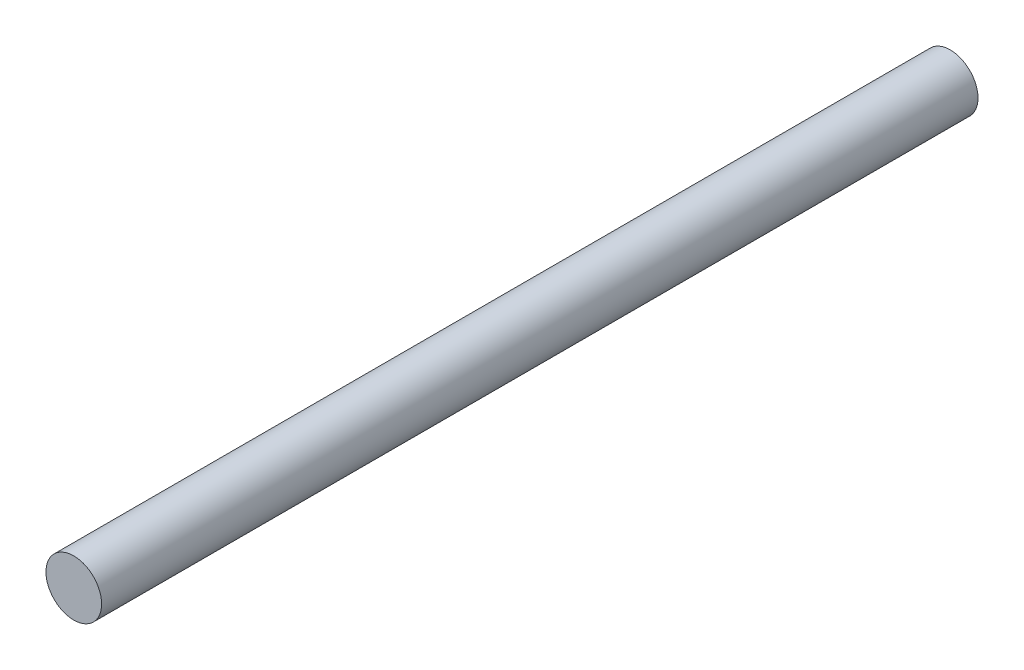
ISO-10303-21;
HEADER;
FILE_DESCRIPTION(('STEP AP214'),'2;1');
FILE_NAME('part.step','',(''),(''),'','','');
FILE_SCHEMA(('AUTOMOTIVE_DESIGN { 1 0 10303 214 1 1 1 1 }'));
ENDSEC;
DATA;
#1=APPLICATION_CONTEXT('core data for automotive mechanical design processes');
#2=APPLICATION_PROTOCOL_DEFINITION('international standard','automotive_design',2000,#1);
#3=PRODUCT_CONTEXT('',#1,'mechanical');
#4=PRODUCT('Part','Part','',(#3));
#5=PRODUCT_RELATED_PRODUCT_CATEGORY('part','',(#4));
#6=PRODUCT_DEFINITION_FORMATION('','',#4);
#7=PRODUCT_DEFINITION_CONTEXT('part definition',#1,'design');
#8=PRODUCT_DEFINITION('design','',#6,#7);
#9=PRODUCT_DEFINITION_SHAPE('','',#8);
#10=(LENGTH_UNIT() NAMED_UNIT(*) SI_UNIT(.MILLI.,.METRE.));
#11=(NAMED_UNIT(*) PLANE_ANGLE_UNIT() SI_UNIT($,.RADIAN.));
#12=(NAMED_UNIT(*) SI_UNIT($,.STERADIAN.) SOLID_ANGLE_UNIT());
#13=UNCERTAINTY_MEASURE_WITH_UNIT(LENGTH_MEASURE(1.E-05),#10,'distance_accuracy_value','');
#14=(GEOMETRIC_REPRESENTATION_CONTEXT(3) GLOBAL_UNCERTAINTY_ASSIGNED_CONTEXT((#13)) GLOBAL_UNIT_ASSIGNED_CONTEXT((#10,
#11,#12)) REPRESENTATION_CONTEXT('',''));
#15=CARTESIAN_POINT('',(0.,0.,0.));
#16=DIRECTION('',(0.,0.,1.));
#17=DIRECTION('',(1.,0.,0.));
#18=AXIS2_PLACEMENT_3D('',#15,#16,#17);
#19=CARTESIAN_POINT('',(0.,0.,200.));
#20=DIRECTION('',(0.,0.,-1.));
#21=DIRECTION('',(-1.,0.,0.));
#22=AXIS2_PLACEMENT_3D('',#19,#20,#21);
#23=CYLINDRICAL_SURFACE('',#22,6.35);
#24=CARTESIAN_POINT('',(0.,0.,200.));
#25=DIRECTION('',(0.,0.,1.));
#26=DIRECTION('',(1.,0.,0.));
#27=AXIS2_PLACEMENT_3D('',#24,#25,#26);
#28=CIRCLE('',#27,6.35);
#29=CARTESIAN_POINT('',(6.35,0.,200.));
#30=VERTEX_POINT('',#29);
#31=EDGE_CURVE('E10',#30,#30,#28,.T.);
#32=ORIENTED_EDGE('',*,*,#31,.F.);
#33=EDGE_LOOP('',(#32));
#34=FACE_BOUND('',#33,.T.);
#35=CARTESIAN_POINT('',(0.,0.,0.));
#36=DIRECTION('',(0.,0.,1.));
#37=DIRECTION('',(1.,0.,0.));
#38=AXIS2_PLACEMENT_3D('',#35,#36,#37);
#39=CIRCLE('',#38,6.35);
#40=CARTESIAN_POINT('',(6.35,0.,0.));
#41=VERTEX_POINT('',#40);
#42=EDGE_CURVE('E36',#41,#41,#39,.T.);
#43=ORIENTED_EDGE('',*,*,#42,.T.);
#44=EDGE_LOOP('',(#43));
#45=FACE_BOUND('',#44,.T.);
#46=ADVANCED_FACE('F33',(#34,#45),#23,.T.);
#47=CARTESIAN_POINT('',(0.,0.,200.));
#48=DIRECTION('',(0.,0.,1.));
#49=DIRECTION('',(1.,0.,0.));
#50=AXIS2_PLACEMENT_3D('',#47,#48,#49);
#51=PLANE('',#50);
#52=ORIENTED_EDGE('',*,*,#31,.T.);
#53=EDGE_LOOP('',(#52));
#54=FACE_BOUND('',#53,.T.);
#55=ADVANCED_FACE('F48',(#54),#51,.T.);
#56=CARTESIAN_POINT('',(0.,0.,0.));
#57=DIRECTION('',(0.,0.,1.));
#58=DIRECTION('',(1.,0.,0.));
#59=AXIS2_PLACEMENT_3D('',#56,#57,#58);
#60=PLANE('',#59);
#61=ORIENTED_EDGE('',*,*,#42,.F.);
#62=EDGE_LOOP('',(#61));
#63=FACE_BOUND('',#62,.T.);
#64=ADVANCED_FACE('F46',(#63),#60,.F.);
#65=CLOSED_SHELL('',(#46,#55,#64));
#66=MANIFOLD_SOLID_BREP('B2',#65);
#67=ADVANCED_BREP_SHAPE_REPRESENTATION('',(#18,#66),#14);
#68=SHAPE_DEFINITION_REPRESENTATION(#9,#67);
ENDSEC;
END-ISO-10303-21;
